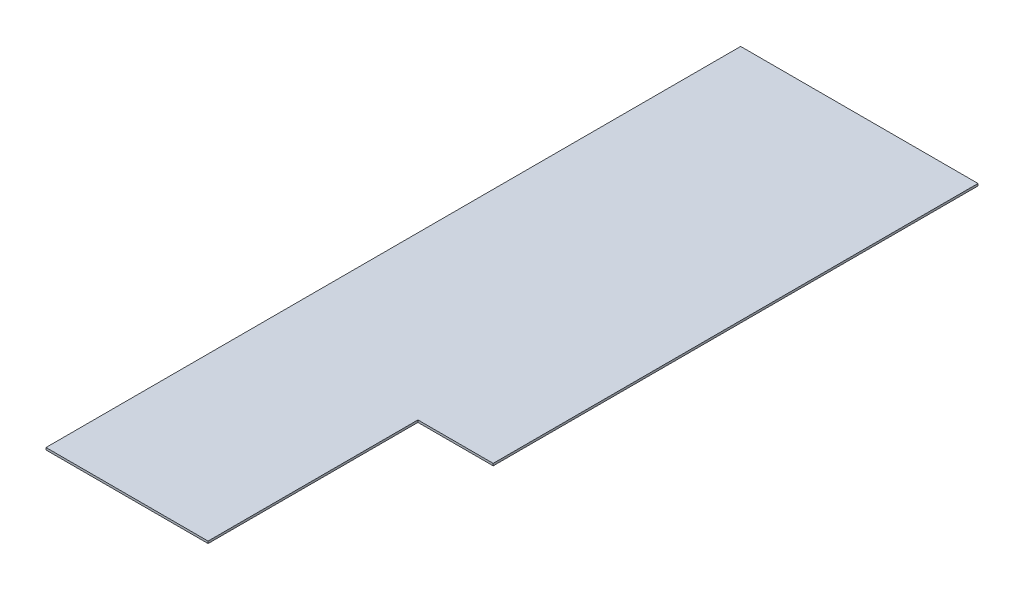
ISO-10303-21;
HEADER;
FILE_DESCRIPTION(('STEP AP214'),'2;1');
FILE_NAME('part.step','',(''),(''),'','','');
FILE_SCHEMA(('AUTOMOTIVE_DESIGN { 1 0 10303 214 1 1 1 1 }'));
ENDSEC;
DATA;
#1=APPLICATION_CONTEXT('core data for automotive mechanical design processes');
#2=APPLICATION_PROTOCOL_DEFINITION('international standard','automotive_design',2000,#1);
#3=PRODUCT_CONTEXT('',#1,'mechanical');
#4=PRODUCT('Part','Part','',(#3));
#5=PRODUCT_RELATED_PRODUCT_CATEGORY('part','',(#4));
#6=PRODUCT_DEFINITION_FORMATION('','',#4);
#7=PRODUCT_DEFINITION_CONTEXT('part definition',#1,'design');
#8=PRODUCT_DEFINITION('design','',#6,#7);
#9=PRODUCT_DEFINITION_SHAPE('','',#8);
#10=(LENGTH_UNIT() NAMED_UNIT(*) SI_UNIT(.MILLI.,.METRE.));
#11=(NAMED_UNIT(*) PLANE_ANGLE_UNIT() SI_UNIT($,.RADIAN.));
#12=(NAMED_UNIT(*) SI_UNIT($,.STERADIAN.) SOLID_ANGLE_UNIT());
#13=UNCERTAINTY_MEASURE_WITH_UNIT(LENGTH_MEASURE(1.E-05),#10,'distance_accuracy_value','');
#14=(GEOMETRIC_REPRESENTATION_CONTEXT(3) GLOBAL_UNCERTAINTY_ASSIGNED_CONTEXT((#13)) GLOBAL_UNIT_ASSIGNED_CONTEXT((#10,
#11,#12)) REPRESENTATION_CONTEXT('',''));
#15=CARTESIAN_POINT('',(0.,0.,0.));
#16=DIRECTION('',(0.,0.,1.));
#17=DIRECTION('',(1.,0.,0.));
#18=AXIS2_PLACEMENT_3D('',#15,#16,#17);
#19=CARTESIAN_POINT('',(-260.35,4.7752,0.));
#20=DIRECTION('',(1.,0.,0.));
#21=DIRECTION('',(0.,0.,-1.));
#22=AXIS2_PLACEMENT_3D('',#19,#20,#21);
#23=PLANE('',#22);
#24=DIRECTION('',(0.,0.,1.));
#25=VECTOR('',#24,1.);
#26=CARTESIAN_POINT('',(-260.35,0.,0.));
#27=LINE('',#26,#25);
#28=CARTESIAN_POINT('',(-260.35,0.,-1524.));
#29=VERTEX_POINT('',#28);
#30=CARTESIAN_POINT('',(-260.35,0.,0.));
#31=VERTEX_POINT('',#30);
#32=EDGE_CURVE('E120',#29,#31,#27,.T.);
#33=ORIENTED_EDGE('',*,*,#32,.T.);
#34=DIRECTION('',(0.,-1.,0.));
#35=VECTOR('',#34,1.);
#36=CARTESIAN_POINT('',(-260.35,4.7752,0.));
#37=LINE('',#36,#35);
#38=CARTESIAN_POINT('',(-260.35,4.7752,0.));
#39=VERTEX_POINT('',#38);
#40=EDGE_CURVE('E11',#39,#31,#37,.T.);
#41=ORIENTED_EDGE('',*,*,#40,.F.);
#42=DIRECTION('',(0.,0.,1.));
#43=VECTOR('',#42,1.);
#44=CARTESIAN_POINT('',(-260.35,4.7752,0.));
#45=LINE('',#44,#43);
#46=CARTESIAN_POINT('',(-260.35,4.7752,-1524.));
#47=VERTEX_POINT('',#46);
#48=EDGE_CURVE('E117',#47,#39,#45,.T.);
#49=ORIENTED_EDGE('',*,*,#48,.F.);
#50=DIRECTION('',(0.,-1.,0.));
#51=VECTOR('',#50,1.);
#52=CARTESIAN_POINT('',(-260.35,4.7752,-1524.));
#53=LINE('',#52,#51);
#54=EDGE_CURVE('E124',#47,#29,#53,.T.);
#55=ORIENTED_EDGE('',*,*,#54,.T.);
#56=EDGE_LOOP('',(#33,#41,#49,#55));
#57=FACE_BOUND('',#56,.T.);
#58=ADVANCED_FACE('F34',(#57),#23,.F.);
#59=CARTESIAN_POINT('',(-260.35,4.7752,0.));
#60=DIRECTION('',(0.,0.,-1.));
#61=DIRECTION('',(-1.,0.,0.));
#62=AXIS2_PLACEMENT_3D('',#59,#60,#61);
#63=PLANE('',#62);
#64=DIRECTION('',(1.,0.,0.));
#65=VECTOR('',#64,1.);
#66=CARTESIAN_POINT('',(-260.35,0.,0.));
#67=LINE('',#66,#65);
#68=CARTESIAN_POINT('',(95.25,0.,0.));
#69=VERTEX_POINT('',#68);
#70=EDGE_CURVE('E115',#31,#69,#67,.T.);
#71=ORIENTED_EDGE('',*,*,#70,.T.);
#72=DIRECTION('',(0.,1.,0.));
#73=VECTOR('',#72,1.);
#74=CARTESIAN_POINT('',(95.25,0.,0.));
#75=LINE('',#74,#73);
#76=CARTESIAN_POINT('',(95.25,4.7752,0.));
#77=VERTEX_POINT('',#76);
#78=EDGE_CURVE('E131',#69,#77,#75,.T.);
#79=ORIENTED_EDGE('',*,*,#78,.T.);
#80=DIRECTION('',(1.,0.,0.));
#81=VECTOR('',#80,1.);
#82=CARTESIAN_POINT('',(-260.35,4.7752,0.));
#83=LINE('',#82,#81);
#84=EDGE_CURVE('E80',#39,#77,#83,.T.);
#85=ORIENTED_EDGE('',*,*,#84,.F.);
#86=ORIENTED_EDGE('',*,*,#40,.T.);
#87=EDGE_LOOP('',(#71,#79,#85,#86));
#88=FACE_BOUND('',#87,.T.);
#89=ADVANCED_FACE('F141',(#88),#63,.F.);
#90=CARTESIAN_POINT('',(260.35,4.7752,0.));
#91=DIRECTION('',(-1.,0.,0.));
#92=DIRECTION('',(0.,0.,1.));
#93=AXIS2_PLACEMENT_3D('',#90,#91,#92);
#94=PLANE('',#93);
#95=DIRECTION('',(0.,0.,-1.));
#96=VECTOR('',#95,1.);
#97=CARTESIAN_POINT('',(260.35,4.7752,0.));
#98=LINE('',#97,#96);
#99=CARTESIAN_POINT('',(260.35,4.7752,-460.375));
#100=VERTEX_POINT('',#99);
#101=CARTESIAN_POINT('',(260.349999999999,4.7752,-1524.));
#102=VERTEX_POINT('',#101);
#103=EDGE_CURVE('E111',#100,#102,#98,.T.);
#104=ORIENTED_EDGE('',*,*,#103,.F.);
#105=DIRECTION('',(0.,1.,0.));
#106=VECTOR('',#105,1.);
#107=CARTESIAN_POINT('',(260.35,0.,-460.375));
#108=LINE('',#107,#106);
#109=CARTESIAN_POINT('',(260.35,0.,-460.375));
#110=VERTEX_POINT('',#109);
#111=EDGE_CURVE('E99',#110,#100,#108,.T.);
#112=ORIENTED_EDGE('',*,*,#111,.F.);
#113=DIRECTION('',(0.,0.,-1.));
#114=VECTOR('',#113,1.);
#115=CARTESIAN_POINT('',(260.35,0.,0.));
#116=LINE('',#115,#114);
#117=CARTESIAN_POINT('',(260.349999999999,0.,-1524.));
#118=VERTEX_POINT('',#117);
#119=EDGE_CURVE('E110',#110,#118,#116,.T.);
#120=ORIENTED_EDGE('',*,*,#119,.T.);
#121=DIRECTION('',(0.,-1.,0.));
#122=VECTOR('',#121,1.);
#123=CARTESIAN_POINT('',(260.349999999999,4.7752,-1524.));
#124=LINE('',#123,#122);
#125=EDGE_CURVE('E41',#102,#118,#124,.T.);
#126=ORIENTED_EDGE('',*,*,#125,.F.);
#127=EDGE_LOOP('',(#104,#112,#120,#126));
#128=FACE_BOUND('',#127,.T.);
#129=ADVANCED_FACE('F108',(#128),#94,.F.);
#130=CARTESIAN_POINT('',(-260.35,4.7752,-1524.));
#131=DIRECTION('',(0.,0.,1.));
#132=DIRECTION('',(1.,0.,0.));
#133=AXIS2_PLACEMENT_3D('',#130,#131,#132);
#134=PLANE('',#133);
#135=DIRECTION('',(-1.,0.,0.));
#136=VECTOR('',#135,1.);
#137=CARTESIAN_POINT('',(-260.35,0.,-1524.));
#138=LINE('',#137,#136);
#139=EDGE_CURVE('E74',#118,#29,#138,.T.);
#140=ORIENTED_EDGE('',*,*,#139,.T.);
#141=ORIENTED_EDGE('',*,*,#54,.F.);
#142=DIRECTION('',(-1.,0.,0.));
#143=VECTOR('',#142,1.);
#144=CARTESIAN_POINT('',(-260.35,4.7752,-1524.));
#145=LINE('',#144,#143);
#146=EDGE_CURVE('E57',#102,#47,#145,.T.);
#147=ORIENTED_EDGE('',*,*,#146,.F.);
#148=ORIENTED_EDGE('',*,*,#125,.T.);
#149=EDGE_LOOP('',(#140,#141,#147,#148));
#150=FACE_BOUND('',#149,.T.);
#151=ADVANCED_FACE('F125',(#150),#134,.F.);
#152=CARTESIAN_POINT('',(0.,4.7752,0.));
#153=DIRECTION('',(0.,-1.,0.));
#154=DIRECTION('',(0.,0.,-1.));
#155=AXIS2_PLACEMENT_3D('',#152,#153,#154);
#156=PLANE('',#155);
#157=ORIENTED_EDGE('',*,*,#84,.T.);
#158=DIRECTION('',(0.,0.,1.));
#159=VECTOR('',#158,1.);
#160=CARTESIAN_POINT('',(95.25,4.7752,0.));
#161=LINE('',#160,#159);
#162=CARTESIAN_POINT('',(95.25,4.7752,-460.375));
#163=VERTEX_POINT('',#162);
#164=EDGE_CURVE('E104',#163,#77,#161,.T.);
#165=ORIENTED_EDGE('',*,*,#164,.F.);
#166=DIRECTION('',(-1.,0.,0.));
#167=VECTOR('',#166,1.);
#168=CARTESIAN_POINT('',(260.35,4.7752,-460.375));
#169=LINE('',#168,#167);
#170=EDGE_CURVE('E143',#100,#163,#169,.T.);
#171=ORIENTED_EDGE('',*,*,#170,.F.);
#172=ORIENTED_EDGE('',*,*,#103,.T.);
#173=ORIENTED_EDGE('',*,*,#146,.T.);
#174=ORIENTED_EDGE('',*,*,#48,.T.);
#175=EDGE_LOOP('',(#157,#165,#171,#172,#173,#174));
#176=FACE_BOUND('',#175,.T.);
#177=ADVANCED_FACE('F140',(#176),#156,.F.);
#178=CARTESIAN_POINT('',(0.,0.,0.));
#179=DIRECTION('',(0.,-1.,0.));
#180=DIRECTION('',(0.,0.,-1.));
#181=AXIS2_PLACEMENT_3D('',#178,#179,#180);
#182=PLANE('',#181);
#183=DIRECTION('',(0.,0.,1.));
#184=VECTOR('',#183,1.);
#185=CARTESIAN_POINT('',(95.25,0.,0.));
#186=LINE('',#185,#184);
#187=CARTESIAN_POINT('',(95.25,0.,-460.375));
#188=VERTEX_POINT('',#187);
#189=EDGE_CURVE('E48',#188,#69,#186,.T.);
#190=ORIENTED_EDGE('',*,*,#189,.T.);
#191=ORIENTED_EDGE('',*,*,#70,.F.);
#192=ORIENTED_EDGE('',*,*,#32,.F.);
#193=ORIENTED_EDGE('',*,*,#139,.F.);
#194=ORIENTED_EDGE('',*,*,#119,.F.);
#195=DIRECTION('',(-1.,0.,0.));
#196=VECTOR('',#195,1.);
#197=CARTESIAN_POINT('',(260.35,0.,-460.375));
#198=LINE('',#197,#196);
#199=EDGE_CURVE('E95',#110,#188,#198,.T.);
#200=ORIENTED_EDGE('',*,*,#199,.T.);
#201=EDGE_LOOP('',(#190,#191,#192,#193,#194,#200));
#202=FACE_BOUND('',#201,.T.);
#203=ADVANCED_FACE('F113',(#202),#182,.T.);
#204=CARTESIAN_POINT('',(95.25,0.,0.));
#205=DIRECTION('',(-1.,0.,0.));
#206=DIRECTION('',(0.,0.,1.));
#207=AXIS2_PLACEMENT_3D('',#204,#205,#206);
#208=PLANE('',#207);
#209=ORIENTED_EDGE('',*,*,#164,.T.);
#210=ORIENTED_EDGE('',*,*,#78,.F.);
#211=ORIENTED_EDGE('',*,*,#189,.F.);
#212=DIRECTION('',(0.,1.,0.));
#213=VECTOR('',#212,1.);
#214=CARTESIAN_POINT('',(95.25,0.,-460.375));
#215=LINE('',#214,#213);
#216=EDGE_CURVE('E101',#188,#163,#215,.T.);
#217=ORIENTED_EDGE('',*,*,#216,.T.);
#218=EDGE_LOOP('',(#209,#210,#211,#217));
#219=FACE_BOUND('',#218,.T.);
#220=ADVANCED_FACE('F144',(#219),#208,.F.);
#221=CARTESIAN_POINT('',(260.35,0.,-460.375));
#222=DIRECTION('',(0.,0.,-1.));
#223=DIRECTION('',(-1.,0.,0.));
#224=AXIS2_PLACEMENT_3D('',#221,#222,#223);
#225=PLANE('',#224);
#226=ORIENTED_EDGE('',*,*,#170,.T.);
#227=ORIENTED_EDGE('',*,*,#216,.F.);
#228=ORIENTED_EDGE('',*,*,#199,.F.);
#229=ORIENTED_EDGE('',*,*,#111,.T.);
#230=EDGE_LOOP('',(#226,#227,#228,#229));
#231=FACE_BOUND('',#230,.T.);
#232=ADVANCED_FACE('F98',(#231),#225,.F.);
#233=CLOSED_SHELL('',(#58,#89,#129,#151,#177,#203,#220,#232));
#234=MANIFOLD_SOLID_BREP('B2',#233);
#235=ADVANCED_BREP_SHAPE_REPRESENTATION('',(#18,#234),#14);
#236=SHAPE_DEFINITION_REPRESENTATION(#9,#235);
ENDSEC;
END-ISO-10303-21;
